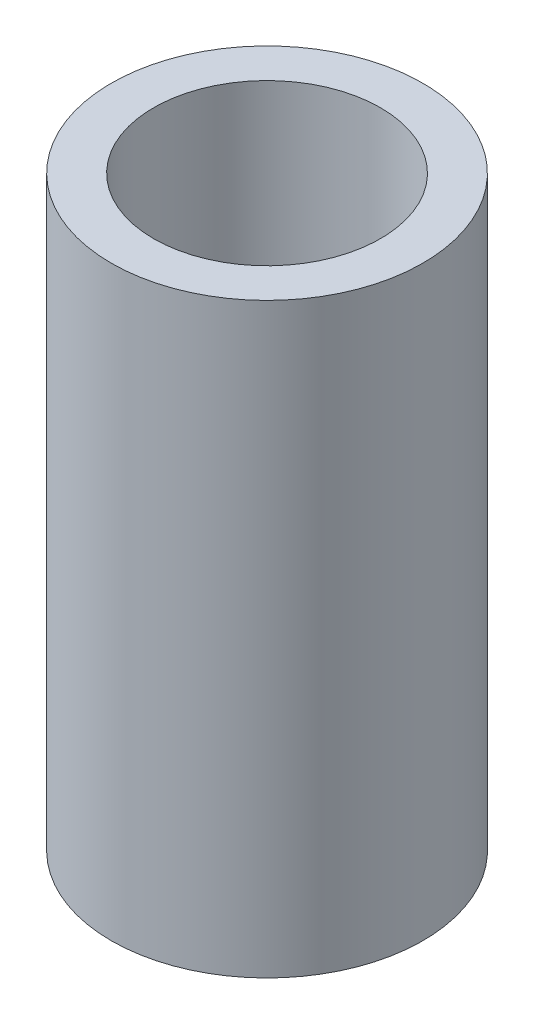
ISO-10303-21;
HEADER;
FILE_DESCRIPTION(('STEP AP214'),'2;1');
FILE_NAME('part.step','',(''),(''),'','','');
FILE_SCHEMA(('AUTOMOTIVE_DESIGN { 1 0 10303 214 1 1 1 1 }'));
ENDSEC;
DATA;
#1=APPLICATION_CONTEXT('core data for automotive mechanical design processes');
#2=APPLICATION_PROTOCOL_DEFINITION('international standard','automotive_design',2000,#1);
#3=PRODUCT_CONTEXT('',#1,'mechanical');
#4=PRODUCT('Part','Part','',(#3));
#5=PRODUCT_RELATED_PRODUCT_CATEGORY('part','',(#4));
#6=PRODUCT_DEFINITION_FORMATION('','',#4);
#7=PRODUCT_DEFINITION_CONTEXT('part definition',#1,'design');
#8=PRODUCT_DEFINITION('design','',#6,#7);
#9=PRODUCT_DEFINITION_SHAPE('','',#8);
#10=(LENGTH_UNIT() NAMED_UNIT(*) SI_UNIT(.MILLI.,.METRE.));
#11=(NAMED_UNIT(*) PLANE_ANGLE_UNIT() SI_UNIT($,.RADIAN.));
#12=(NAMED_UNIT(*) SI_UNIT($,.STERADIAN.) SOLID_ANGLE_UNIT());
#13=UNCERTAINTY_MEASURE_WITH_UNIT(LENGTH_MEASURE(1.E-05),#10,'distance_accuracy_value','');
#14=(GEOMETRIC_REPRESENTATION_CONTEXT(3) GLOBAL_UNCERTAINTY_ASSIGNED_CONTEXT((#13)) GLOBAL_UNIT_ASSIGNED_CONTEXT((#10,
#11,#12)) REPRESENTATION_CONTEXT('',''));
#15=CARTESIAN_POINT('',(0.,0.,0.));
#16=DIRECTION('',(0.,0.,1.));
#17=DIRECTION('',(1.,0.,0.));
#18=AXIS2_PLACEMENT_3D('',#15,#16,#17);
#19=CARTESIAN_POINT('',(0.,65.8935726883075,0.));
#20=DIRECTION('',(0.,-1.,0.));
#21=DIRECTION('',(0.,0.,-1.));
#22=AXIS2_PLACEMENT_3D('',#19,#20,#21);
#23=CYLINDRICAL_SURFACE('',#22,17.5);
#24=CARTESIAN_POINT('',(0.,65.8935726883075,0.));
#25=DIRECTION('',(0.,1.,0.));
#26=DIRECTION('',(0.,0.,1.));
#27=AXIS2_PLACEMENT_3D('',#24,#25,#26);
#28=CIRCLE('',#27,17.5);
#29=CARTESIAN_POINT('',(0.,65.8935726883075,17.5));
#30=VERTEX_POINT('',#29);
#31=EDGE_CURVE('E10',#30,#30,#28,.T.);
#32=ORIENTED_EDGE('',*,*,#31,.F.);
#33=EDGE_LOOP('',(#32));
#34=FACE_BOUND('',#33,.T.);
#35=CARTESIAN_POINT('',(0.,0.,0.));
#36=DIRECTION('',(0.,1.,0.));
#37=DIRECTION('',(0.,0.,1.));
#38=AXIS2_PLACEMENT_3D('',#35,#36,#37);
#39=CIRCLE('',#38,17.5);
#40=CARTESIAN_POINT('',(0.,0.,17.5));
#41=VERTEX_POINT('',#40);
#42=EDGE_CURVE('E37',#41,#41,#39,.T.);
#43=ORIENTED_EDGE('',*,*,#42,.T.);
#44=EDGE_LOOP('',(#43));
#45=FACE_BOUND('',#44,.T.);
#46=ADVANCED_FACE('F40',(#34,#45),#23,.T.);
#47=CARTESIAN_POINT('',(0.,65.8935726883075,0.));
#48=DIRECTION('',(0.,1.,0.));
#49=DIRECTION('',(0.,0.,1.));
#50=AXIS2_PLACEMENT_3D('',#47,#48,#49);
#51=PLANE('',#50);
#52=CARTESIAN_POINT('',(0.,65.8935726883075,0.));
#53=DIRECTION('',(0.,1.,0.));
#54=DIRECTION('',(0.,0.,1.));
#55=AXIS2_PLACEMENT_3D('',#52,#53,#54);
#56=CIRCLE('',#55,12.7398522501447);
#57=CARTESIAN_POINT('',(0.,65.8935726883075,12.7398522501447));
#58=VERTEX_POINT('',#57);
#59=EDGE_CURVE('E50',#58,#58,#56,.T.);
#60=ORIENTED_EDGE('',*,*,#59,.F.);
#61=EDGE_LOOP('',(#60));
#62=FACE_BOUND('',#61,.T.);
#63=ORIENTED_EDGE('',*,*,#31,.T.);
#64=EDGE_LOOP('',(#63));
#65=FACE_BOUND('',#64,.T.);
#66=ADVANCED_FACE('F59',(#62,#65),#51,.T.);
#67=CARTESIAN_POINT('',(0.,0.,0.));
#68=DIRECTION('',(0.,1.,0.));
#69=DIRECTION('',(0.,0.,1.));
#70=AXIS2_PLACEMENT_3D('',#67,#68,#69);
#71=PLANE('',#70);
#72=CARTESIAN_POINT('',(0.,0.,0.));
#73=DIRECTION('',(0.,1.,0.));
#74=DIRECTION('',(0.,0.,1.));
#75=AXIS2_PLACEMENT_3D('',#72,#73,#74);
#76=CIRCLE('',#75,12.7398522501447);
#77=CARTESIAN_POINT('',(0.,0.,12.7398522501447));
#78=VERTEX_POINT('',#77);
#79=EDGE_CURVE('E47',#78,#78,#76,.T.);
#80=ORIENTED_EDGE('',*,*,#79,.T.);
#81=EDGE_LOOP('',(#80));
#82=FACE_BOUND('',#81,.T.);
#83=ORIENTED_EDGE('',*,*,#42,.F.);
#84=EDGE_LOOP('',(#83));
#85=FACE_BOUND('',#84,.T.);
#86=ADVANCED_FACE('F58',(#82,#85),#71,.F.);
#87=CARTESIAN_POINT('',(0.,65.8935726883075,0.));
#88=DIRECTION('',(0.,-1.,0.));
#89=DIRECTION('',(0.,0.,-1.));
#90=AXIS2_PLACEMENT_3D('',#87,#88,#89);
#91=CYLINDRICAL_SURFACE('',#90,12.7398522501447);
#92=ORIENTED_EDGE('',*,*,#59,.T.);
#93=EDGE_LOOP('',(#92));
#94=FACE_BOUND('',#93,.T.);
#95=ORIENTED_EDGE('',*,*,#79,.F.);
#96=EDGE_LOOP('',(#95));
#97=FACE_BOUND('',#96,.T.);
#98=ADVANCED_FACE('F54',(#94,#97),#91,.F.);
#99=CLOSED_SHELL('',(#46,#66,#86,#98));
#100=MANIFOLD_SOLID_BREP('B2',#99);
#101=ADVANCED_BREP_SHAPE_REPRESENTATION('',(#18,#100),#14);
#102=SHAPE_DEFINITION_REPRESENTATION(#9,#101);
ENDSEC;
END-ISO-10303-21;
